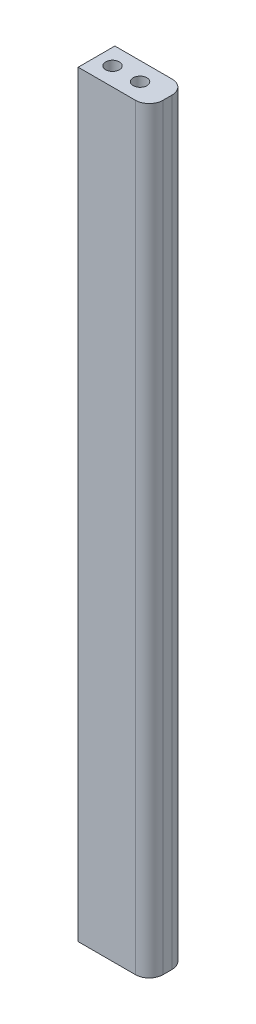
ISO-10303-21;
HEADER;
FILE_DESCRIPTION(('STEP AP214'),'2;1');
FILE_NAME('part.step','',(''),(''),'','','');
FILE_SCHEMA(('AUTOMOTIVE_DESIGN { 1 0 10303 214 1 1 1 1 }'));
ENDSEC;
DATA;
#1=APPLICATION_CONTEXT('core data for automotive mechanical design processes');
#2=APPLICATION_PROTOCOL_DEFINITION('international standard','automotive_design',2000,#1);
#3=PRODUCT_CONTEXT('',#1,'mechanical');
#4=PRODUCT('Part','Part','',(#3));
#5=PRODUCT_RELATED_PRODUCT_CATEGORY('part','',(#4));
#6=PRODUCT_DEFINITION_FORMATION('','',#4);
#7=PRODUCT_DEFINITION_CONTEXT('part definition',#1,'design');
#8=PRODUCT_DEFINITION('design','',#6,#7);
#9=PRODUCT_DEFINITION_SHAPE('','',#8);
#10=(LENGTH_UNIT() NAMED_UNIT(*) SI_UNIT(.MILLI.,.METRE.));
#11=(NAMED_UNIT(*) PLANE_ANGLE_UNIT() SI_UNIT($,.RADIAN.));
#12=(NAMED_UNIT(*) SI_UNIT($,.STERADIAN.) SOLID_ANGLE_UNIT());
#13=UNCERTAINTY_MEASURE_WITH_UNIT(LENGTH_MEASURE(1.E-05),#10,'distance_accuracy_value','');
#14=(GEOMETRIC_REPRESENTATION_CONTEXT(3) GLOBAL_UNCERTAINTY_ASSIGNED_CONTEXT((#13)) GLOBAL_UNIT_ASSIGNED_CONTEXT((#10,
#11,#12)) REPRESENTATION_CONTEXT('',''));
#15=CARTESIAN_POINT('',(0.,0.,0.));
#16=DIRECTION('',(0.,0.,1.));
#17=DIRECTION('',(1.,0.,0.));
#18=AXIS2_PLACEMENT_3D('',#15,#16,#17);
#19=CARTESIAN_POINT('',(-17.7139714190534,165.,-0.170664551917457));
#20=DIRECTION('',(0.,1.,0.));
#21=DIRECTION('',(0.,0.,1.));
#22=AXIS2_PLACEMENT_3D('',#19,#20,#21);
#23=PLANE('',#22);
#24=CARTESIAN_POINT('',(-20.7139714190534,165.,0.825127674177011));
#25=DIRECTION('',(0.,1.,0.));
#26=DIRECTION('',(0.,0.,-1.));
#27=AXIS2_PLACEMENT_3D('',#24,#25,#26);
#28=CIRCLE('',#27,1.5);
#29=CARTESIAN_POINT('',(-20.7139714190534,165.,-0.674872325822986));
#30=VERTEX_POINT('',#29);
#31=EDGE_CURVE('E122',#30,#30,#28,.T.);
#32=ORIENTED_EDGE('',*,*,#31,.F.);
#33=EDGE_LOOP('',(#32));
#34=FACE_BOUND('',#33,.T.);
#35=CARTESIAN_POINT('',(-17.7139714190534,165.,-0.170664551917457));
#36=DIRECTION('',(0.,1.,0.));
#37=DIRECTION('',(0.,0.,1.));
#38=AXIS2_PLACEMENT_3D('',#35,#36,#37);
#39=CIRCLE('',#38,3.);
#40=CARTESIAN_POINT('',(-14.7139714190534,165.,-0.170664551917436));
#41=VERTEX_POINT('',#40);
#42=CARTESIAN_POINT('',(-17.7139714190534,165.,-3.17066455191746));
#43=VERTEX_POINT('',#42);
#44=EDGE_CURVE('E129',#41,#43,#39,.T.);
#45=ORIENTED_EDGE('',*,*,#44,.T.);
#46=DIRECTION('',(-1.,0.,0.));
#47=VECTOR('',#46,1.);
#48=CARTESIAN_POINT('',(-19.637232632183,165.,-3.17066455191746));
#49=LINE('',#48,#47);
#50=CARTESIAN_POINT('',(-30.1945724040309,165.,-3.17066455191746));
#51=VERTEX_POINT('',#50);
#52=EDGE_CURVE('E87',#43,#51,#49,.T.);
#53=ORIENTED_EDGE('',*,*,#52,.T.);
#54=DIRECTION('',(0.,0.,1.));
#55=VECTOR('',#54,1.);
#56=CARTESIAN_POINT('',(-30.1945724040309,165.,4.82512767417701));
#57=LINE('',#56,#55);
#58=CARTESIAN_POINT('',(-30.1945724040309,165.,4.82512767417701));
#59=VERTEX_POINT('',#58);
#60=EDGE_CURVE('E100',#51,#59,#57,.T.);
#61=ORIENTED_EDGE('',*,*,#60,.T.);
#62=DIRECTION('',(1.,0.,0.));
#63=VECTOR('',#62,1.);
#64=CARTESIAN_POINT('',(-30.1945724040309,165.,4.82512767417701));
#65=LINE('',#64,#63);
#66=CARTESIAN_POINT('',(-17.7139714190534,165.,4.82512767417702));
#67=VERTEX_POINT('',#66);
#68=EDGE_CURVE('E94',#59,#67,#65,.T.);
#69=ORIENTED_EDGE('',*,*,#68,.T.);
#70=CARTESIAN_POINT('',(-17.7139714190534,165.,1.82512767417702));
#71=DIRECTION('',(0.,1.,0.));
#72=DIRECTION('',(0.,0.,-1.));
#73=AXIS2_PLACEMENT_3D('',#70,#71,#72);
#74=CIRCLE('',#73,3.);
#75=CARTESIAN_POINT('',(-14.7139714190534,165.,1.82512767417699));
#76=VERTEX_POINT('',#75);
#77=EDGE_CURVE('E98',#67,#76,#74,.T.);
#78=ORIENTED_EDGE('',*,*,#77,.T.);
#79=DIRECTION('',(0.,0.,-1.));
#80=VECTOR('',#79,1.);
#81=CARTESIAN_POINT('',(-14.7139714190534,165.,-0.170664551917436));
#82=LINE('',#81,#80);
#83=EDGE_CURVE('E50',#76,#41,#82,.T.);
#84=ORIENTED_EDGE('',*,*,#83,.T.);
#85=EDGE_LOOP('',(#45,#53,#61,#69,#78,#84));
#86=FACE_BOUND('',#85,.T.);
#87=CARTESIAN_POINT('',(-26.7139714190534,165.,0.825127674177011));
#88=DIRECTION('',(0.,1.,0.));
#89=DIRECTION('',(0.,0.,-1.));
#90=AXIS2_PLACEMENT_3D('',#87,#88,#89);
#91=CIRCLE('',#90,1.5);
#92=CARTESIAN_POINT('',(-26.7139714190534,165.,-0.674872325822985));
#93=VERTEX_POINT('',#92);
#94=EDGE_CURVE('E171',#93,#93,#91,.T.);
#95=ORIENTED_EDGE('',*,*,#94,.F.);
#96=EDGE_LOOP('',(#95));
#97=FACE_BOUND('',#96,.T.);
#98=ADVANCED_FACE('F33',(#34,#86,#97),#23,.T.);
#99=CARTESIAN_POINT('',(-17.7139714190534,0.,-0.170664551917457));
#100=DIRECTION('',(0.,1.,0.));
#101=DIRECTION('',(0.,0.,1.));
#102=AXIS2_PLACEMENT_3D('',#99,#100,#101);
#103=PLANE('',#102);
#104=CARTESIAN_POINT('',(-17.7139714190534,0.,-0.170664551917457));
#105=DIRECTION('',(0.,1.,0.));
#106=DIRECTION('',(0.,0.,1.));
#107=AXIS2_PLACEMENT_3D('',#104,#105,#106);
#108=CIRCLE('',#107,3.);
#109=CARTESIAN_POINT('',(-14.7139714190534,0.,-0.170664551917436));
#110=VERTEX_POINT('',#109);
#111=CARTESIAN_POINT('',(-17.7139714190534,0.,-3.17066455191746));
#112=VERTEX_POINT('',#111);
#113=EDGE_CURVE('E118',#110,#112,#108,.T.);
#114=ORIENTED_EDGE('',*,*,#113,.F.);
#115=DIRECTION('',(0.,0.,-1.));
#116=VECTOR('',#115,1.);
#117=CARTESIAN_POINT('',(-14.7139714190534,0.,-0.170664551917436));
#118=LINE('',#117,#116);
#119=CARTESIAN_POINT('',(-14.7139714190534,0.,1.82512767417699));
#120=VERTEX_POINT('',#119);
#121=EDGE_CURVE('E79',#120,#110,#118,.T.);
#122=ORIENTED_EDGE('',*,*,#121,.F.);
#123=CARTESIAN_POINT('',(-17.7139714190534,0.,1.82512767417702));
#124=DIRECTION('',(0.,1.,0.));
#125=DIRECTION('',(0.,0.,-1.));
#126=AXIS2_PLACEMENT_3D('',#123,#124,#125);
#127=CIRCLE('',#126,3.);
#128=CARTESIAN_POINT('',(-17.7139714190534,0.,4.82512767417702));
#129=VERTEX_POINT('',#128);
#130=EDGE_CURVE('E73',#129,#120,#127,.T.);
#131=ORIENTED_EDGE('',*,*,#130,.F.);
#132=DIRECTION('',(1.,0.,0.));
#133=VECTOR('',#132,1.);
#134=CARTESIAN_POINT('',(-30.1945724040309,0.,4.82512767417701));
#135=LINE('',#134,#133);
#136=CARTESIAN_POINT('',(-30.1945724040309,0.,4.82512767417701));
#137=VERTEX_POINT('',#136);
#138=EDGE_CURVE('E108',#137,#129,#135,.T.);
#139=ORIENTED_EDGE('',*,*,#138,.F.);
#140=DIRECTION('',(0.,0.,1.));
#141=VECTOR('',#140,1.);
#142=CARTESIAN_POINT('',(-30.1945724040309,0.,4.82512767417701));
#143=LINE('',#142,#141);
#144=CARTESIAN_POINT('',(-30.1945724040309,0.,-3.17066455191746));
#145=VERTEX_POINT('',#144);
#146=EDGE_CURVE('E124',#145,#137,#143,.T.);
#147=ORIENTED_EDGE('',*,*,#146,.F.);
#148=DIRECTION('',(-1.,0.,0.));
#149=VECTOR('',#148,1.);
#150=CARTESIAN_POINT('',(-19.637232632183,0.,-3.17066455191746));
#151=LINE('',#150,#149);
#152=EDGE_CURVE('E121',#112,#145,#151,.T.);
#153=ORIENTED_EDGE('',*,*,#152,.F.);
#154=EDGE_LOOP('',(#114,#122,#131,#139,#147,#153));
#155=FACE_BOUND('',#154,.T.);
#156=CARTESIAN_POINT('',(-20.7139714190534,0.,0.825127674177011));
#157=DIRECTION('',(0.,1.,0.));
#158=DIRECTION('',(0.,0.,-1.));
#159=AXIS2_PLACEMENT_3D('',#156,#157,#158);
#160=CIRCLE('',#159,1.5);
#161=CARTESIAN_POINT('',(-20.7139714190534,0.,-0.674872325822986));
#162=VERTEX_POINT('',#161);
#163=EDGE_CURVE('E177',#162,#162,#160,.T.);
#164=ORIENTED_EDGE('',*,*,#163,.T.);
#165=EDGE_LOOP('',(#164));
#166=FACE_BOUND('',#165,.T.);
#167=CARTESIAN_POINT('',(-26.7139714190534,0.,0.825127674177011));
#168=DIRECTION('',(0.,1.,0.));
#169=DIRECTION('',(0.,0.,-1.));
#170=AXIS2_PLACEMENT_3D('',#167,#168,#169);
#171=CIRCLE('',#170,1.5);
#172=CARTESIAN_POINT('',(-26.7139714190534,0.,-0.674872325822985));
#173=VERTEX_POINT('',#172);
#174=EDGE_CURVE('E174',#173,#173,#171,.T.);
#175=ORIENTED_EDGE('',*,*,#174,.T.);
#176=EDGE_LOOP('',(#175));
#177=FACE_BOUND('',#176,.T.);
#178=ADVANCED_FACE('F138',(#155,#166,#177),#103,.F.);
#179=CARTESIAN_POINT('',(-17.7139714190534,165.,-0.170664551917457));
#180=DIRECTION('',(0.,-1.,0.));
#181=DIRECTION('',(0.,0.,-1.));
#182=AXIS2_PLACEMENT_3D('',#179,#180,#181);
#183=CYLINDRICAL_SURFACE('',#182,3.);
#184=ORIENTED_EDGE('',*,*,#113,.T.);
#185=DIRECTION('',(0.,-1.,0.));
#186=VECTOR('',#185,1.);
#187=CARTESIAN_POINT('',(-17.7139714190534,165.,-3.17066455191746));
#188=LINE('',#187,#186);
#189=EDGE_CURVE('E11',#43,#112,#188,.T.);
#190=ORIENTED_EDGE('',*,*,#189,.F.);
#191=ORIENTED_EDGE('',*,*,#44,.F.);
#192=DIRECTION('',(0.,-1.,0.));
#193=VECTOR('',#192,1.);
#194=CARTESIAN_POINT('',(-14.7139714190534,165.,-0.170664551917436));
#195=LINE('',#194,#193);
#196=EDGE_CURVE('E114',#41,#110,#195,.T.);
#197=ORIENTED_EDGE('',*,*,#196,.T.);
#198=EDGE_LOOP('',(#184,#190,#191,#197));
#199=FACE_BOUND('',#198,.T.);
#200=ADVANCED_FACE('F35',(#199),#183,.T.);
#201=CARTESIAN_POINT('',(-19.637232632183,165.,-3.17066455191746));
#202=DIRECTION('',(0.,0.,1.));
#203=DIRECTION('',(1.,0.,0.));
#204=AXIS2_PLACEMENT_3D('',#201,#202,#203);
#205=PLANE('',#204);
#206=ORIENTED_EDGE('',*,*,#152,.T.);
#207=DIRECTION('',(0.,-1.,0.));
#208=VECTOR('',#207,1.);
#209=CARTESIAN_POINT('',(-30.1945724040309,165.,-3.17066455191746));
#210=LINE('',#209,#208);
#211=EDGE_CURVE('E42',#51,#145,#210,.T.);
#212=ORIENTED_EDGE('',*,*,#211,.F.);
#213=ORIENTED_EDGE('',*,*,#52,.F.);
#214=ORIENTED_EDGE('',*,*,#189,.T.);
#215=EDGE_LOOP('',(#206,#212,#213,#214));
#216=FACE_BOUND('',#215,.T.);
#217=ADVANCED_FACE('F218',(#216),#205,.F.);
#218=CARTESIAN_POINT('',(-30.1945724040309,165.,4.82512767417701));
#219=DIRECTION('',(1.,0.,0.));
#220=DIRECTION('',(0.,0.,-1.));
#221=AXIS2_PLACEMENT_3D('',#218,#219,#220);
#222=PLANE('',#221);
#223=ORIENTED_EDGE('',*,*,#146,.T.);
#224=DIRECTION('',(0.,-1.,0.));
#225=VECTOR('',#224,1.);
#226=CARTESIAN_POINT('',(-30.1945724040309,165.,4.82512767417701));
#227=LINE('',#226,#225);
#228=EDGE_CURVE('E109',#59,#137,#227,.T.);
#229=ORIENTED_EDGE('',*,*,#228,.F.);
#230=ORIENTED_EDGE('',*,*,#60,.F.);
#231=ORIENTED_EDGE('',*,*,#211,.T.);
#232=EDGE_LOOP('',(#223,#229,#230,#231));
#233=FACE_BOUND('',#232,.T.);
#234=ADVANCED_FACE('F135',(#233),#222,.F.);
#235=CARTESIAN_POINT('',(-30.1945724040309,165.,4.82512767417701));
#236=DIRECTION('',(0.,0.,-1.));
#237=DIRECTION('',(-1.,0.,0.));
#238=AXIS2_PLACEMENT_3D('',#235,#236,#237);
#239=PLANE('',#238);
#240=ORIENTED_EDGE('',*,*,#138,.T.);
#241=DIRECTION('',(0.,-1.,0.));
#242=VECTOR('',#241,1.);
#243=CARTESIAN_POINT('',(-17.7139714190534,165.,4.82512767417702));
#244=LINE('',#243,#242);
#245=EDGE_CURVE('E105',#67,#129,#244,.T.);
#246=ORIENTED_EDGE('',*,*,#245,.F.);
#247=ORIENTED_EDGE('',*,*,#68,.F.);
#248=ORIENTED_EDGE('',*,*,#228,.T.);
#249=EDGE_LOOP('',(#240,#246,#247,#248));
#250=FACE_BOUND('',#249,.T.);
#251=ADVANCED_FACE('F106',(#250),#239,.F.);
#252=CARTESIAN_POINT('',(-17.7139714190534,165.,1.82512767417702));
#253=DIRECTION('',(0.,-1.,0.));
#254=DIRECTION('',(0.,0.,-1.));
#255=AXIS2_PLACEMENT_3D('',#252,#253,#254);
#256=CYLINDRICAL_SURFACE('',#255,3.);
#257=ORIENTED_EDGE('',*,*,#130,.T.);
#258=DIRECTION('',(0.,-1.,0.));
#259=VECTOR('',#258,1.);
#260=CARTESIAN_POINT('',(-14.7139714190534,165.,1.82512767417699));
#261=LINE('',#260,#259);
#262=EDGE_CURVE('E110',#76,#120,#261,.T.);
#263=ORIENTED_EDGE('',*,*,#262,.F.);
#264=ORIENTED_EDGE('',*,*,#77,.F.);
#265=ORIENTED_EDGE('',*,*,#245,.T.);
#266=EDGE_LOOP('',(#257,#263,#264,#265));
#267=FACE_BOUND('',#266,.T.);
#268=ADVANCED_FACE('F112',(#267),#256,.T.);
#269=CARTESIAN_POINT('',(-14.7139714190534,165.,-0.170664551917436));
#270=DIRECTION('',(-1.,0.,0.));
#271=DIRECTION('',(0.,0.,1.));
#272=AXIS2_PLACEMENT_3D('',#269,#270,#271);
#273=PLANE('',#272);
#274=ORIENTED_EDGE('',*,*,#121,.T.);
#275=ORIENTED_EDGE('',*,*,#196,.F.);
#276=ORIENTED_EDGE('',*,*,#83,.F.);
#277=ORIENTED_EDGE('',*,*,#262,.T.);
#278=EDGE_LOOP('',(#274,#275,#276,#277));
#279=FACE_BOUND('',#278,.T.);
#280=ADVANCED_FACE('F143',(#279),#273,.F.);
#281=CARTESIAN_POINT('',(-20.7139714190534,165.,0.825127674177011));
#282=DIRECTION('',(0.,-1.,0.));
#283=DIRECTION('',(0.,0.,-1.));
#284=AXIS2_PLACEMENT_3D('',#281,#282,#283);
#285=CYLINDRICAL_SURFACE('',#284,1.5);
#286=ORIENTED_EDGE('',*,*,#31,.T.);
#287=EDGE_LOOP('',(#286));
#288=FACE_BOUND('',#287,.T.);
#289=ORIENTED_EDGE('',*,*,#163,.F.);
#290=EDGE_LOOP('',(#289));
#291=FACE_BOUND('',#290,.T.);
#292=ADVANCED_FACE('F145',(#288,#291),#285,.F.);
#293=CARTESIAN_POINT('',(-26.7139714190534,165.,0.825127674177011));
#294=DIRECTION('',(0.,-1.,0.));
#295=DIRECTION('',(0.,0.,-1.));
#296=AXIS2_PLACEMENT_3D('',#293,#294,#295);
#297=CYLINDRICAL_SURFACE('',#296,1.5);
#298=ORIENTED_EDGE('',*,*,#94,.T.);
#299=EDGE_LOOP('',(#298));
#300=FACE_BOUND('',#299,.T.);
#301=ORIENTED_EDGE('',*,*,#174,.F.);
#302=EDGE_LOOP('',(#301));
#303=FACE_BOUND('',#302,.T.);
#304=ADVANCED_FACE('F151',(#300,#303),#297,.F.);
#305=CLOSED_SHELL('',(#98,#178,#200,#217,#234,#251,#268,#280,#292,#304));
#306=MANIFOLD_SOLID_BREP('B2',#305);
#307=ADVANCED_BREP_SHAPE_REPRESENTATION('',(#18,#306),#14);
#308=SHAPE_DEFINITION_REPRESENTATION(#9,#307);
ENDSEC;
END-ISO-10303-21;
